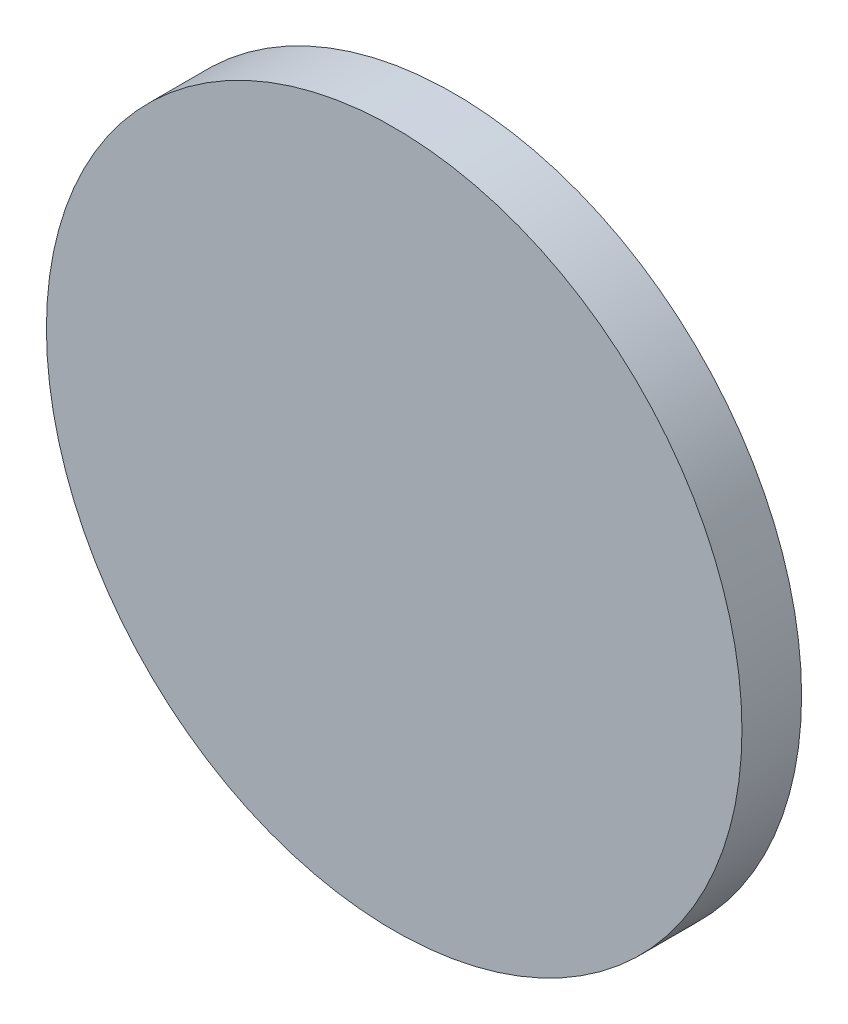
ISO-10303-21;
HEADER;
FILE_DESCRIPTION(('STEP AP214'),'2;1');
FILE_NAME('part.step','',(''),(''),'','','');
FILE_SCHEMA(('AUTOMOTIVE_DESIGN { 1 0 10303 214 1 1 1 1 }'));
ENDSEC;
DATA;
#1=APPLICATION_CONTEXT('core data for automotive mechanical design processes');
#2=APPLICATION_PROTOCOL_DEFINITION('international standard','automotive_design',2000,#1);
#3=PRODUCT_CONTEXT('',#1,'mechanical');
#4=PRODUCT('Part','Part','',(#3));
#5=PRODUCT_RELATED_PRODUCT_CATEGORY('part','',(#4));
#6=PRODUCT_DEFINITION_FORMATION('','',#4);
#7=PRODUCT_DEFINITION_CONTEXT('part definition',#1,'design');
#8=PRODUCT_DEFINITION('design','',#6,#7);
#9=PRODUCT_DEFINITION_SHAPE('','',#8);
#10=(LENGTH_UNIT() NAMED_UNIT(*) SI_UNIT(.MILLI.,.METRE.));
#11=(NAMED_UNIT(*) PLANE_ANGLE_UNIT() SI_UNIT($,.RADIAN.));
#12=(NAMED_UNIT(*) SI_UNIT($,.STERADIAN.) SOLID_ANGLE_UNIT());
#13=UNCERTAINTY_MEASURE_WITH_UNIT(LENGTH_MEASURE(1.E-05),#10,'distance_accuracy_value','');
#14=(GEOMETRIC_REPRESENTATION_CONTEXT(3) GLOBAL_UNCERTAINTY_ASSIGNED_CONTEXT((#13)) GLOBAL_UNIT_ASSIGNED_CONTEXT((#10,
#11,#12)) REPRESENTATION_CONTEXT('',''));
#15=CARTESIAN_POINT('',(0.,0.,0.));
#16=DIRECTION('',(0.,0.,1.));
#17=DIRECTION('',(1.,0.,0.));
#18=AXIS2_PLACEMENT_3D('',#15,#16,#17);
#19=CARTESIAN_POINT('',(9.551,3.339000014875,0.));
#20=DIRECTION('',(0.,0.,-1.));
#21=DIRECTION('',(-1.,0.,0.));
#22=AXIS2_PLACEMENT_3D('',#19,#20,#21);
#23=PLANE('',#22);
#24=CARTESIAN_POINT('',(9.551,3.339000014875,0.));
#25=DIRECTION('',(0.,0.,1.));
#26=DIRECTION('',(1.,0.,0.));
#27=AXIS2_PLACEMENT_3D('',#24,#25,#26);
#28=CIRCLE('',#27,0.200024667);
#29=CARTESIAN_POINT('',(9.751024667,3.339000014875,0.));
#30=VERTEX_POINT('',#29);
#31=EDGE_CURVE('E18',#30,#30,#28,.T.);
#32=ORIENTED_EDGE('',*,*,#31,.F.);
#33=EDGE_LOOP('',(#32));
#34=FACE_BOUND('',#33,.T.);
#35=ADVANCED_FACE('F15',(#34),#23,.T.);
#36=CARTESIAN_POINT('',(9.551,3.339000014875,0.));
#37=DIRECTION('',(0.,0.,1.));
#38=DIRECTION('',(1.,0.,0.));
#39=AXIS2_PLACEMENT_3D('',#36,#37,#38);
#40=CYLINDRICAL_SURFACE('',#39,0.200024667);
#41=CARTESIAN_POINT('',(9.551,3.339000014875,0.03429));
#42=DIRECTION('',(0.,0.,1.));
#43=DIRECTION('',(1.,0.,0.));
#44=AXIS2_PLACEMENT_3D('',#41,#42,#43);
#45=CIRCLE('',#44,0.200024667);
#46=CARTESIAN_POINT('',(9.751024667,3.339000014875,0.03429));
#47=VERTEX_POINT('',#46);
#48=EDGE_CURVE('E10',#47,#47,#45,.T.);
#49=ORIENTED_EDGE('',*,*,#48,.F.);
#50=EDGE_LOOP('',(#49));
#51=FACE_BOUND('',#50,.T.);
#52=ORIENTED_EDGE('',*,*,#31,.T.);
#53=EDGE_LOOP('',(#52));
#54=FACE_BOUND('',#53,.T.);
#55=ADVANCED_FACE('F27',(#51,#54),#40,.T.);
#56=CARTESIAN_POINT('',(9.551,3.339000014875,0.03429));
#57=DIRECTION('',(0.,0.,1.));
#58=DIRECTION('',(1.,0.,0.));
#59=AXIS2_PLACEMENT_3D('',#56,#57,#58);
#60=PLANE('',#59);
#61=ORIENTED_EDGE('',*,*,#48,.T.);
#62=EDGE_LOOP('',(#61));
#63=FACE_BOUND('',#62,.T.);
#64=ADVANCED_FACE('F34',(#63),#60,.T.);
#65=CLOSED_SHELL('',(#35,#55,#64));
#66=MANIFOLD_SOLID_BREP('B1',#65);
#67=ADVANCED_BREP_SHAPE_REPRESENTATION('',(#18,#66),#14);
#68=SHAPE_DEFINITION_REPRESENTATION(#9,#67);
ENDSEC;
END-ISO-10303-21;
